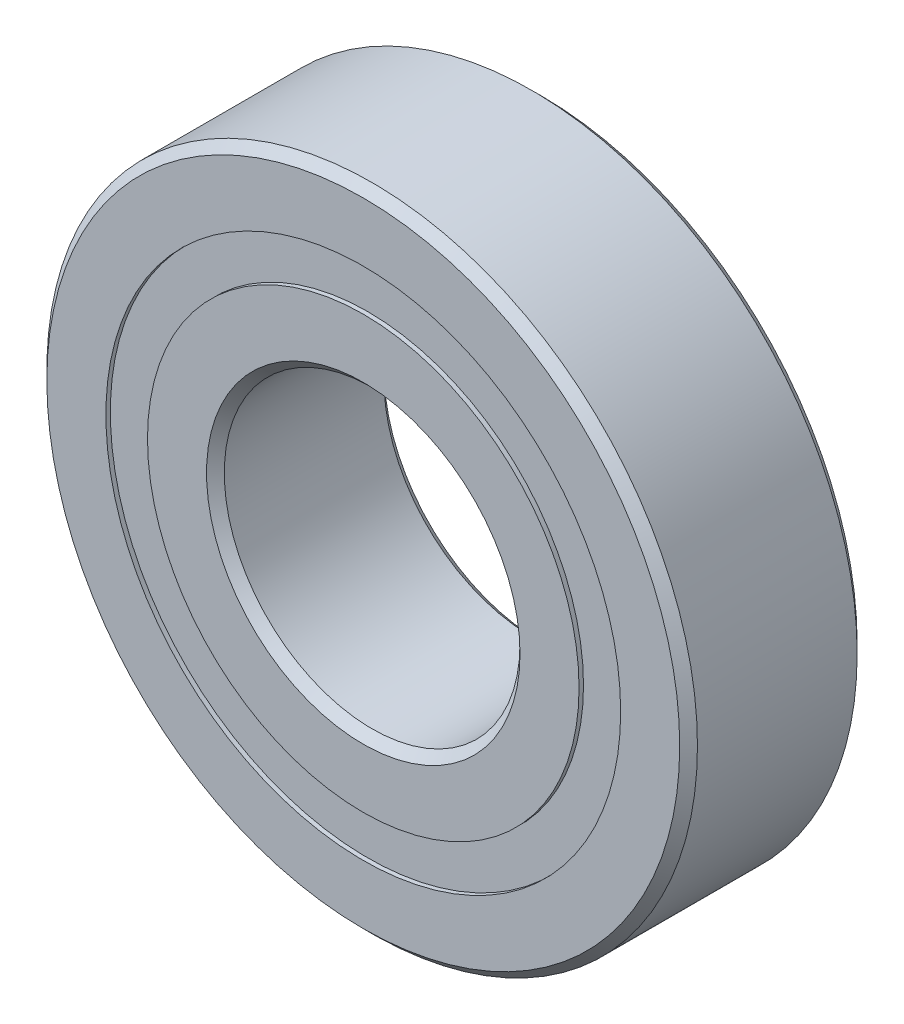
ISO-10303-21;
HEADER;
FILE_DESCRIPTION(('STEP AP214'),'2;1');
FILE_NAME('part.step','',(''),(''),'','','');
FILE_SCHEMA(('AUTOMOTIVE_DESIGN { 1 0 10303 214 1 1 1 1 }'));
ENDSEC;
DATA;
#1=APPLICATION_CONTEXT('core data for automotive mechanical design processes');
#2=APPLICATION_PROTOCOL_DEFINITION('international standard','automotive_design',2000,#1);
#3=PRODUCT_CONTEXT('',#1,'mechanical');
#4=PRODUCT('Part','Part','',(#3));
#5=PRODUCT_RELATED_PRODUCT_CATEGORY('part','',(#4));
#6=PRODUCT_DEFINITION_FORMATION('','',#4);
#7=PRODUCT_DEFINITION_CONTEXT('part definition',#1,'design');
#8=PRODUCT_DEFINITION('design','',#6,#7);
#9=PRODUCT_DEFINITION_SHAPE('','',#8);
#10=(LENGTH_UNIT() NAMED_UNIT(*) SI_UNIT(.MILLI.,.METRE.));
#11=(NAMED_UNIT(*) PLANE_ANGLE_UNIT() SI_UNIT($,.RADIAN.));
#12=(NAMED_UNIT(*) SI_UNIT($,.STERADIAN.) SOLID_ANGLE_UNIT());
#13=UNCERTAINTY_MEASURE_WITH_UNIT(LENGTH_MEASURE(1.E-05),#10,'distance_accuracy_value','');
#14=(GEOMETRIC_REPRESENTATION_CONTEXT(3) GLOBAL_UNCERTAINTY_ASSIGNED_CONTEXT((#13)) GLOBAL_UNIT_ASSIGNED_CONTEXT((#10,
#11,#12)) REPRESENTATION_CONTEXT('',''));
#15=CARTESIAN_POINT('',(0.,0.,0.));
#16=DIRECTION('',(0.,0.,1.));
#17=DIRECTION('',(1.,0.,0.));
#18=AXIS2_PLACEMENT_3D('',#15,#16,#17);
#19=CARTESIAN_POINT('',(0.,8.7032967032967,-2.85000000000001));
#20=DIRECTION('',(0.,0.,1.));
#21=DIRECTION('',(1.,0.,0.));
#22=AXIS2_PLACEMENT_3D('',#19,#20,#21);
#23=PLANE('',#22);
#24=CARTESIAN_POINT('',(0.,0.,-2.85));
#25=DIRECTION('',(0.,0.,1.));
#26=DIRECTION('',(1.,0.,0.));
#27=AXIS2_PLACEMENT_3D('',#24,#25,#26);
#28=CIRCLE('',#27,8.7032967032967);
#29=CARTESIAN_POINT('',(8.7032967032967,0.,-2.85));
#30=VERTEX_POINT('',#29);
#31=EDGE_CURVE('E57',#30,#30,#28,.T.);
#32=ORIENTED_EDGE('',*,*,#31,.F.);
#33=EDGE_LOOP('',(#32));
#34=FACE_BOUND('',#33,.T.);
#35=CARTESIAN_POINT('',(0.,0.,-2.85000000000001));
#36=DIRECTION('',(0.,0.,1.));
#37=DIRECTION('',(1.,0.,0.));
#38=AXIS2_PLACEMENT_3D('',#35,#36,#37);
#39=CIRCLE('',#38,7.2967032967033);
#40=CARTESIAN_POINT('',(7.2967032967033,0.,-2.85000000000001));
#41=VERTEX_POINT('',#40);
#42=EDGE_CURVE('E11',#41,#41,#39,.T.);
#43=ORIENTED_EDGE('',*,*,#42,.T.);
#44=EDGE_LOOP('',(#43));
#45=FACE_BOUND('',#44,.T.);
#46=ADVANCED_FACE('F43',(#34,#45),#23,.F.);
#47=CARTESIAN_POINT('',(0.,0.,3.));
#48=DIRECTION('',(0.,0.,1.));
#49=DIRECTION('',(1.,0.,0.));
#50=AXIS2_PLACEMENT_3D('',#47,#48,#49);
#51=CYLINDRICAL_SURFACE('',#50,7.2967032967033);
#52=ORIENTED_EDGE('',*,*,#42,.F.);
#53=EDGE_LOOP('',(#52));
#54=FACE_BOUND('',#53,.T.);
#55=CARTESIAN_POINT('',(0.,0.,-1.50744951180655));
#56=DIRECTION('',(0.,0.,1.));
#57=DIRECTION('',(1.,0.,0.));
#58=AXIS2_PLACEMENT_3D('',#55,#56,#57);
#59=CIRCLE('',#58,7.2967032967033);
#60=CARTESIAN_POINT('',(7.2967032967033,0.,-1.50744951180655));
#61=VERTEX_POINT('',#60);
#62=EDGE_CURVE('E49',#61,#61,#59,.T.);
#63=ORIENTED_EDGE('',*,*,#62,.T.);
#64=EDGE_LOOP('',(#63));
#65=FACE_BOUND('',#64,.T.);
#66=ADVANCED_FACE('F66',(#54,#65),#51,.F.);
#67=CARTESIAN_POINT('',(0.,8.7032967032967,-1.50744951180655));
#68=DIRECTION('',(0.,0.,-1.));
#69=DIRECTION('',(-1.,0.,0.));
#70=AXIS2_PLACEMENT_3D('',#67,#68,#69);
#71=PLANE('',#70);
#72=ORIENTED_EDGE('',*,*,#62,.F.);
#73=EDGE_LOOP('',(#72));
#74=FACE_BOUND('',#73,.T.);
#75=CARTESIAN_POINT('',(0.,0.,-1.50744951180655));
#76=DIRECTION('',(0.,0.,1.));
#77=DIRECTION('',(1.,0.,0.));
#78=AXIS2_PLACEMENT_3D('',#75,#76,#77);
#79=CIRCLE('',#78,8.7032967032967);
#80=CARTESIAN_POINT('',(8.7032967032967,0.,-1.50744951180655));
#81=VERTEX_POINT('',#80);
#82=EDGE_CURVE('E53',#81,#81,#79,.T.);
#83=ORIENTED_EDGE('',*,*,#82,.T.);
#84=EDGE_LOOP('',(#83));
#85=FACE_BOUND('',#84,.T.);
#86=ADVANCED_FACE('F70',(#74,#85),#71,.F.);
#87=CARTESIAN_POINT('',(0.,0.,3.));
#88=DIRECTION('',(0.,0.,1.));
#89=DIRECTION('',(1.,0.,0.));
#90=AXIS2_PLACEMENT_3D('',#87,#88,#89);
#91=CYLINDRICAL_SURFACE('',#90,8.7032967032967);
#92=ORIENTED_EDGE('',*,*,#82,.F.);
#93=EDGE_LOOP('',(#92));
#94=FACE_BOUND('',#93,.T.);
#95=ORIENTED_EDGE('',*,*,#31,.T.);
#96=EDGE_LOOP('',(#95));
#97=FACE_BOUND('',#96,.T.);
#98=ADVANCED_FACE('F63',(#94,#97),#91,.T.);
#99=CLOSED_SHELL('',(#46,#66,#86,#98));
#100=MANIFOLD_SOLID_BREP('B2',#99);
#101=CARTESIAN_POINT('',(0.,8.7032967032967,2.85));
#102=DIRECTION('',(0.,0.,-1.));
#103=DIRECTION('',(-1.,0.,0.));
#104=AXIS2_PLACEMENT_3D('',#101,#102,#103);
#105=PLANE('',#104);
#106=CARTESIAN_POINT('',(0.,0.,2.85));
#107=DIRECTION('',(0.,0.,1.));
#108=DIRECTION('',(1.,0.,0.));
#109=AXIS2_PLACEMENT_3D('',#106,#107,#108);
#110=CIRCLE('',#109,7.2967032967033);
#111=CARTESIAN_POINT('',(7.2967032967033,0.,2.85));
#112=VERTEX_POINT('',#111);
#113=EDGE_CURVE('E42',#112,#112,#110,.T.);
#114=ORIENTED_EDGE('',*,*,#113,.F.);
#115=EDGE_LOOP('',(#114));
#116=FACE_BOUND('',#115,.T.);
#117=CARTESIAN_POINT('',(0.,0.,2.85));
#118=DIRECTION('',(0.,0.,1.));
#119=DIRECTION('',(1.,0.,0.));
#120=AXIS2_PLACEMENT_3D('',#117,#118,#119);
#121=CIRCLE('',#120,8.7032967032967);
#122=CARTESIAN_POINT('',(8.7032967032967,0.,2.85));
#123=VERTEX_POINT('',#122);
#124=EDGE_CURVE('E124',#123,#123,#121,.T.);
#125=ORIENTED_EDGE('',*,*,#124,.T.);
#126=EDGE_LOOP('',(#125));
#127=FACE_BOUND('',#126,.T.);
#128=ADVANCED_FACE('F110',(#116,#127),#105,.F.);
#129=CARTESIAN_POINT('',(0.,0.,3.));
#130=DIRECTION('',(0.,0.,1.));
#131=DIRECTION('',(1.,0.,0.));
#132=AXIS2_PLACEMENT_3D('',#129,#130,#131);
#133=CYLINDRICAL_SURFACE('',#132,7.2967032967033);
#134=CARTESIAN_POINT('',(0.,0.,1.50744951180654));
#135=DIRECTION('',(0.,0.,1.));
#136=DIRECTION('',(1.,0.,0.));
#137=AXIS2_PLACEMENT_3D('',#134,#135,#136);
#138=CIRCLE('',#137,7.2967032967033);
#139=CARTESIAN_POINT('',(7.2967032967033,0.,1.50744951180654));
#140=VERTEX_POINT('',#139);
#141=EDGE_CURVE('E116',#140,#140,#138,.T.);
#142=ORIENTED_EDGE('',*,*,#141,.F.);
#143=EDGE_LOOP('',(#142));
#144=FACE_BOUND('',#143,.T.);
#145=ORIENTED_EDGE('',*,*,#113,.T.);
#146=EDGE_LOOP('',(#145));
#147=FACE_BOUND('',#146,.T.);
#148=ADVANCED_FACE('F139',(#144,#147),#133,.F.);
#149=CARTESIAN_POINT('',(0.,8.7032967032967,1.50744951180654));
#150=DIRECTION('',(0.,0.,1.));
#151=DIRECTION('',(1.,0.,0.));
#152=AXIS2_PLACEMENT_3D('',#149,#150,#151);
#153=PLANE('',#152);
#154=CARTESIAN_POINT('',(0.,0.,1.50744951180654));
#155=DIRECTION('',(0.,0.,1.));
#156=DIRECTION('',(1.,0.,0.));
#157=AXIS2_PLACEMENT_3D('',#154,#155,#156);
#158=CIRCLE('',#157,8.7032967032967);
#159=CARTESIAN_POINT('',(8.7032967032967,0.,1.50744951180654));
#160=VERTEX_POINT('',#159);
#161=EDGE_CURVE('E120',#160,#160,#158,.T.);
#162=ORIENTED_EDGE('',*,*,#161,.F.);
#163=EDGE_LOOP('',(#162));
#164=FACE_BOUND('',#163,.T.);
#165=ORIENTED_EDGE('',*,*,#141,.T.);
#166=EDGE_LOOP('',(#165));
#167=FACE_BOUND('',#166,.T.);
#168=ADVANCED_FACE('F134',(#164,#167),#153,.F.);
#169=CARTESIAN_POINT('',(0.,0.,3.));
#170=DIRECTION('',(0.,0.,1.));
#171=DIRECTION('',(1.,0.,0.));
#172=AXIS2_PLACEMENT_3D('',#169,#170,#171);
#173=CYLINDRICAL_SURFACE('',#172,8.7032967032967);
#174=ORIENTED_EDGE('',*,*,#124,.F.);
#175=EDGE_LOOP('',(#174));
#176=FACE_BOUND('',#175,.T.);
#177=ORIENTED_EDGE('',*,*,#161,.T.);
#178=EDGE_LOOP('',(#177));
#179=FACE_BOUND('',#178,.T.);
#180=ADVANCED_FACE('F131',(#176,#179),#173,.T.);
#181=CLOSED_SHELL('',(#128,#148,#168,#180));
#182=MANIFOLD_SOLID_BREP('B6',#181);
#183=CARTESIAN_POINT('',(-3.99999999999991,6.92820323027556,0.));
#184=DIRECTION('',(0.,0.,1.));
#185=DIRECTION('',(-0.499999999999989,0.866025403784445,0.));
#186=AXIS2_PLACEMENT_3D('',#183,#184,#185);
#187=SPHERICAL_SURFACE('',#186,1.50744951180654);
#188=CARTESIAN_POINT('',(-3.99999999999991,6.92820323027556,1.50744951180654));
#189=VERTEX_POINT('',#188);
#190=VERTEX_LOOP('',#189);
#191=FACE_BOUND('',#190,.T.);
#192=ADVANCED_FACE('F177',(#191),#187,.T.);
#193=CLOSED_SHELL('',(#192));
#194=MANIFOLD_SOLID_BREP('B37',#193);
#195=CARTESIAN_POINT('',(-6.92820323027546,4.00000000000008,0.));
#196=DIRECTION('',(0.,0.,1.));
#197=DIRECTION('',(-0.866025403784433,0.50000000000001,0.));
#198=AXIS2_PLACEMENT_3D('',#195,#196,#197);
#199=SPHERICAL_SURFACE('',#198,1.50744951180654);
#200=CARTESIAN_POINT('',(-6.92820323027546,4.00000000000008,1.50744951180654));
#201=VERTEX_POINT('',#200);
#202=VERTEX_LOOP('',#201);
#203=FACE_BOUND('',#202,.T.);
#204=ADVANCED_FACE('F197',(#203),#199,.T.);
#205=CLOSED_SHELL('',(#204));
#206=MANIFOLD_SOLID_BREP('B106',#205);
#207=CARTESIAN_POINT('',(-8.,0.,0.));
#208=DIRECTION('',(0.,0.,1.));
#209=DIRECTION('',(-1.,0.,0.));
#210=AXIS2_PLACEMENT_3D('',#207,#208,#209);
#211=SPHERICAL_SURFACE('',#210,1.50744951180654);
#212=CARTESIAN_POINT('',(-8.,0.,1.50744951180654));
#213=VERTEX_POINT('',#212);
#214=VERTEX_LOOP('',#213);
#215=FACE_BOUND('',#214,.T.);
#216=ADVANCED_FACE('F217',(#215),#211,.T.);
#217=CLOSED_SHELL('',(#216));
#218=MANIFOLD_SOLID_BREP('B173',#217);
#219=CARTESIAN_POINT('',(-6.92820323027555,-3.99999999999994,0.));
#220=DIRECTION('',(0.,0.,1.));
#221=DIRECTION('',(-0.866025403784443,-0.499999999999992,0.));
#222=AXIS2_PLACEMENT_3D('',#219,#220,#221);
#223=SPHERICAL_SURFACE('',#222,1.50744951180654);
#224=CARTESIAN_POINT('',(-6.92820323027555,-3.99999999999994,1.50744951180654));
#225=VERTEX_POINT('',#224);
#226=VERTEX_LOOP('',#225);
#227=FACE_BOUND('',#226,.T.);
#228=ADVANCED_FACE('F237',(#227),#223,.T.);
#229=CLOSED_SHELL('',(#228));
#230=MANIFOLD_SOLID_BREP('B193',#229);
#231=CARTESIAN_POINT('',(-4.00000000000006,-6.92820323027548,0.));
#232=DIRECTION('',(0.,0.,1.));
#233=DIRECTION('',(-0.500000000000007,-0.866025403784435,0.));
#234=AXIS2_PLACEMENT_3D('',#231,#232,#233);
#235=SPHERICAL_SURFACE('',#234,1.50744951180654);
#236=CARTESIAN_POINT('',(-4.00000000000006,-6.92820323027548,1.50744951180654));
#237=VERTEX_POINT('',#236);
#238=VERTEX_LOOP('',#237);
#239=FACE_BOUND('',#238,.T.);
#240=ADVANCED_FACE('F257',(#239),#235,.T.);
#241=CLOSED_SHELL('',(#240));
#242=MANIFOLD_SOLID_BREP('B213',#241);
#243=CARTESIAN_POINT('',(0.,-8.,0.));
#244=DIRECTION('',(0.,0.,1.));
#245=DIRECTION('',(0.,-1.,0.));
#246=AXIS2_PLACEMENT_3D('',#243,#244,#245);
#247=SPHERICAL_SURFACE('',#246,1.50744951180654);
#248=CARTESIAN_POINT('',(0.,-8.,1.50744951180654));
#249=VERTEX_POINT('',#248);
#250=VERTEX_LOOP('',#249);
#251=FACE_BOUND('',#250,.T.);
#252=ADVANCED_FACE('F277',(#251),#247,.T.);
#253=CLOSED_SHELL('',(#252));
#254=MANIFOLD_SOLID_BREP('B233',#253);
#255=CARTESIAN_POINT('',(3.99999999999996,-6.92820323027553,0.));
#256=DIRECTION('',(0.,0.,1.));
#257=DIRECTION('',(0.499999999999995,-0.866025403784442,0.));
#258=AXIS2_PLACEMENT_3D('',#255,#256,#257);
#259=SPHERICAL_SURFACE('',#258,1.50744951180654);
#260=CARTESIAN_POINT('',(3.99999999999996,-6.92820323027553,1.50744951180654));
#261=VERTEX_POINT('',#260);
#262=VERTEX_LOOP('',#261);
#263=FACE_BOUND('',#262,.T.);
#264=ADVANCED_FACE('F297',(#263),#259,.T.);
#265=CLOSED_SHELL('',(#264));
#266=MANIFOLD_SOLID_BREP('B253',#265);
#267=CARTESIAN_POINT('',(6.92820323027549,-4.00000000000003,0.));
#268=DIRECTION('',(0.,0.,1.));
#269=DIRECTION('',(0.866025403784436,-0.500000000000004,0.));
#270=AXIS2_PLACEMENT_3D('',#267,#268,#269);
#271=SPHERICAL_SURFACE('',#270,1.50744951180654);
#272=CARTESIAN_POINT('',(6.92820323027549,-4.00000000000003,1.50744951180654));
#273=VERTEX_POINT('',#272);
#274=VERTEX_LOOP('',#273);
#275=FACE_BOUND('',#274,.T.);
#276=ADVANCED_FACE('F317',(#275),#271,.T.);
#277=CLOSED_SHELL('',(#276));
#278=MANIFOLD_SOLID_BREP('B273',#277);
#279=CARTESIAN_POINT('',(8.,0.,0.));
#280=DIRECTION('',(0.,0.,1.));
#281=DIRECTION('',(1.,0.,0.));
#282=AXIS2_PLACEMENT_3D('',#279,#280,#281);
#283=SPHERICAL_SURFACE('',#282,1.50744951180654);
#284=CARTESIAN_POINT('',(8.,0.,1.50744951180654));
#285=VERTEX_POINT('',#284);
#286=VERTEX_LOOP('',#285);
#287=FACE_BOUND('',#286,.T.);
#288=ADVANCED_FACE('F337',(#287),#283,.T.);
#289=CLOSED_SHELL('',(#288));
#290=MANIFOLD_SOLID_BREP('B293',#289);
#291=CARTESIAN_POINT('',(6.92820323027552,3.99999999999998,0.));
#292=DIRECTION('',(0.,0.,1.));
#293=DIRECTION('',(0.86602540378444,0.499999999999998,0.));
#294=AXIS2_PLACEMENT_3D('',#291,#292,#293);
#295=SPHERICAL_SURFACE('',#294,1.50744951180654);
#296=CARTESIAN_POINT('',(6.92820323027552,3.99999999999998,1.50744951180654));
#297=VERTEX_POINT('',#296);
#298=VERTEX_LOOP('',#297);
#299=FACE_BOUND('',#298,.T.);
#300=ADVANCED_FACE('F357',(#299),#295,.T.);
#301=CLOSED_SHELL('',(#300));
#302=MANIFOLD_SOLID_BREP('B313',#301);
#303=CARTESIAN_POINT('',(4.00000000000001,6.9282032302755,0.));
#304=DIRECTION('',(0.,0.,1.));
#305=DIRECTION('',(0.500000000000001,0.866025403784438,0.));
#306=AXIS2_PLACEMENT_3D('',#303,#304,#305);
#307=SPHERICAL_SURFACE('',#306,1.50744951180654);
#308=CARTESIAN_POINT('',(4.00000000000001,6.9282032302755,1.50744951180654));
#309=VERTEX_POINT('',#308);
#310=VERTEX_LOOP('',#309);
#311=FACE_BOUND('',#310,.T.);
#312=ADVANCED_FACE('F377',(#311),#307,.T.);
#313=CLOSED_SHELL('',(#312));
#314=MANIFOLD_SOLID_BREP('B333',#313);
#315=CARTESIAN_POINT('',(0.,8.,0.));
#316=DIRECTION('',(0.,0.,1.));
#317=DIRECTION('',(0.,1.,0.));
#318=AXIS2_PLACEMENT_3D('',#315,#316,#317);
#319=SPHERICAL_SURFACE('',#318,1.50744951180654);
#320=CARTESIAN_POINT('',(0.,8.,1.50744951180654));
#321=VERTEX_POINT('',#320);
#322=VERTEX_LOOP('',#321);
#323=FACE_BOUND('',#322,.T.);
#324=ADVANCED_FACE('F399',(#323),#319,.T.);
#325=CLOSED_SHELL('',(#324));
#326=MANIFOLD_SOLID_BREP('B353',#325);
#327=CARTESIAN_POINT('',(0.,7.2967032967033,3.));
#328=DIRECTION('',(0.,0.,-1.));
#329=DIRECTION('',(-1.,0.,0.));
#330=AXIS2_PLACEMENT_3D('',#327,#328,#329);
#331=PLANE('',#330);
#332=CARTESIAN_POINT('',(0.,0.,3.));
#333=DIRECTION('',(0.,0.,1.));
#334=DIRECTION('',(1.,0.,0.));
#335=AXIS2_PLACEMENT_3D('',#332,#333,#334);
#336=CIRCLE('',#335,5.3);
#337=CARTESIAN_POINT('',(5.3,0.,3.));
#338=VERTEX_POINT('',#337);
#339=EDGE_CURVE('E446',#338,#338,#336,.T.);
#340=ORIENTED_EDGE('',*,*,#339,.F.);
#341=EDGE_LOOP('',(#340));
#342=FACE_BOUND('',#341,.T.);
#343=CARTESIAN_POINT('',(0.,0.,3.));
#344=DIRECTION('',(0.,0.,1.));
#345=DIRECTION('',(1.,0.,0.));
#346=AXIS2_PLACEMENT_3D('',#343,#344,#345);
#347=CIRCLE('',#346,7.2967032967033);
#348=CARTESIAN_POINT('',(7.2967032967033,0.,3.));
#349=VERTEX_POINT('',#348);
#350=EDGE_CURVE('E398',#349,#349,#347,.T.);
#351=ORIENTED_EDGE('',*,*,#350,.T.);
#352=EDGE_LOOP('',(#351));
#353=FACE_BOUND('',#352,.T.);
#354=ADVANCED_FACE('F418',(#342,#353),#331,.F.);
#355=CARTESIAN_POINT('',(0.,0.,3.));
#356=DIRECTION('',(0.,0.,1.));
#357=DIRECTION('',(1.,0.,0.));
#358=AXIS2_PLACEMENT_3D('',#355,#356,#357);
#359=CYLINDRICAL_SURFACE('',#358,7.2967032967033);
#360=ORIENTED_EDGE('',*,*,#350,.F.);
#361=EDGE_LOOP('',(#360));
#362=FACE_BOUND('',#361,.T.);
#363=CARTESIAN_POINT('',(0.,0.,1.33333333333333));
#364=DIRECTION('',(0.,0.,1.));
#365=DIRECTION('',(1.,0.,0.));
#366=AXIS2_PLACEMENT_3D('',#363,#364,#365);
#367=CIRCLE('',#366,7.2967032967033);
#368=CARTESIAN_POINT('',(7.2967032967033,0.,1.33333333333333));
#369=VERTEX_POINT('',#368);
#370=EDGE_CURVE('E424',#369,#369,#367,.T.);
#371=ORIENTED_EDGE('',*,*,#370,.T.);
#372=EDGE_LOOP('',(#371));
#373=FACE_BOUND('',#372,.T.);
#374=ADVANCED_FACE('F453',(#362,#373),#359,.T.);
#375=CARTESIAN_POINT('',(0.,0.,0.));
#376=DIRECTION('',(0.,0.,1.));
#377=DIRECTION('',(1.,0.,0.));
#378=AXIS2_PLACEMENT_3D('',#375,#376,#377);
#379=TOROIDAL_SURFACE('',#378,8.,1.50744951180654);
#380=ORIENTED_EDGE('',*,*,#370,.F.);
#381=EDGE_LOOP('',(#380));
#382=FACE_BOUND('',#381,.T.);
#383=CARTESIAN_POINT('',(0.,0.,-1.33333333333333));
#384=DIRECTION('',(0.,0.,1.));
#385=DIRECTION('',(1.,0.,0.));
#386=AXIS2_PLACEMENT_3D('',#383,#384,#385);
#387=CIRCLE('',#386,7.2967032967033);
#388=CARTESIAN_POINT('',(7.2967032967033,0.,-1.33333333333333));
#389=VERTEX_POINT('',#388);
#390=EDGE_CURVE('E428',#389,#389,#387,.T.);
#391=ORIENTED_EDGE('',*,*,#390,.T.);
#392=EDGE_LOOP('',(#391));
#393=FACE_BOUND('',#392,.T.);
#394=ADVANCED_FACE('F457',(#382,#393),#379,.F.);
#395=CARTESIAN_POINT('',(0.,0.,3.));
#396=DIRECTION('',(0.,0.,1.));
#397=DIRECTION('',(1.,0.,0.));
#398=AXIS2_PLACEMENT_3D('',#395,#396,#397);
#399=CYLINDRICAL_SURFACE('',#398,7.2967032967033);
#400=ORIENTED_EDGE('',*,*,#390,.F.);
#401=EDGE_LOOP('',(#400));
#402=FACE_BOUND('',#401,.T.);
#403=CARTESIAN_POINT('',(0.,0.,-3.));
#404=DIRECTION('',(0.,0.,1.));
#405=DIRECTION('',(1.,0.,0.));
#406=AXIS2_PLACEMENT_3D('',#403,#404,#405);
#407=CIRCLE('',#406,7.2967032967033);
#408=CARTESIAN_POINT('',(7.2967032967033,0.,-3.));
#409=VERTEX_POINT('',#408);
#410=EDGE_CURVE('E432',#409,#409,#407,.T.);
#411=ORIENTED_EDGE('',*,*,#410,.T.);
#412=EDGE_LOOP('',(#411));
#413=FACE_BOUND('',#412,.T.);
#414=ADVANCED_FACE('F462',(#402,#413),#399,.T.);
#415=CARTESIAN_POINT('',(0.,5.3,-3.));
#416=DIRECTION('',(0.,0.,1.));
#417=DIRECTION('',(1.,0.,0.));
#418=AXIS2_PLACEMENT_3D('',#415,#416,#417);
#419=PLANE('',#418);
#420=ORIENTED_EDGE('',*,*,#410,.F.);
#421=EDGE_LOOP('',(#420));
#422=FACE_BOUND('',#421,.T.);
#423=CARTESIAN_POINT('',(0.,0.,-3.));
#424=DIRECTION('',(0.,0.,1.));
#425=DIRECTION('',(1.,0.,0.));
#426=AXIS2_PLACEMENT_3D('',#423,#424,#425);
#427=CIRCLE('',#426,5.3);
#428=CARTESIAN_POINT('',(5.3,0.,-3.));
#429=VERTEX_POINT('',#428);
#430=EDGE_CURVE('E437',#429,#429,#427,.T.);
#431=ORIENTED_EDGE('',*,*,#430,.T.);
#432=EDGE_LOOP('',(#431));
#433=FACE_BOUND('',#432,.T.);
#434=ADVANCED_FACE('F468',(#422,#433),#419,.F.);
#435=CARTESIAN_POINT('',(0.,0.,-2.7));
#436=DIRECTION('',(0.,0.,-1.));
#437=DIRECTION('',(-1.,0.,0.));
#438=AXIS2_PLACEMENT_3D('',#435,#436,#437);
#439=CONICAL_SURFACE('',#438,5.,0.785398163397443);
#440=ORIENTED_EDGE('',*,*,#430,.F.);
#441=EDGE_LOOP('',(#440));
#442=FACE_BOUND('',#441,.T.);
#443=CARTESIAN_POINT('',(0.,0.,-2.7));
#444=DIRECTION('',(0.,0.,1.));
#445=DIRECTION('',(1.,0.,0.));
#446=AXIS2_PLACEMENT_3D('',#443,#444,#445);
#447=CIRCLE('',#446,5.);
#448=CARTESIAN_POINT('',(5.,0.,-2.7));
#449=VERTEX_POINT('',#448);
#450=EDGE_CURVE('E440',#449,#449,#447,.T.);
#451=ORIENTED_EDGE('',*,*,#450,.T.);
#452=EDGE_LOOP('',(#451));
#453=FACE_BOUND('',#452,.T.);
#454=ADVANCED_FACE('F472',(#442,#453),#439,.F.);
#455=CARTESIAN_POINT('',(0.,0.,3.));
#456=DIRECTION('',(0.,0.,1.));
#457=DIRECTION('',(1.,0.,0.));
#458=AXIS2_PLACEMENT_3D('',#455,#456,#457);
#459=CYLINDRICAL_SURFACE('',#458,5.);
#460=ORIENTED_EDGE('',*,*,#450,.F.);
#461=EDGE_LOOP('',(#460));
#462=FACE_BOUND('',#461,.T.);
#463=CARTESIAN_POINT('',(0.,0.,2.70000000000001));
#464=DIRECTION('',(0.,0.,1.));
#465=DIRECTION('',(1.,0.,0.));
#466=AXIS2_PLACEMENT_3D('',#463,#464,#465);
#467=CIRCLE('',#466,5.);
#468=CARTESIAN_POINT('',(5.,0.,2.70000000000001));
#469=VERTEX_POINT('',#468);
#470=EDGE_CURVE('E443',#469,#469,#467,.T.);
#471=ORIENTED_EDGE('',*,*,#470,.T.);
#472=EDGE_LOOP('',(#471));
#473=FACE_BOUND('',#472,.T.);
#474=ADVANCED_FACE('F476',(#462,#473),#459,.F.);
#475=CARTESIAN_POINT('',(0.,0.,3.));
#476=DIRECTION('',(0.,0.,1.));
#477=DIRECTION('',(1.,0.,0.));
#478=AXIS2_PLACEMENT_3D('',#475,#476,#477);
#479=CONICAL_SURFACE('',#478,5.3,0.785398163397455);
#480=ORIENTED_EDGE('',*,*,#470,.F.);
#481=EDGE_LOOP('',(#480));
#482=FACE_BOUND('',#481,.T.);
#483=ORIENTED_EDGE('',*,*,#339,.T.);
#484=EDGE_LOOP('',(#483));
#485=FACE_BOUND('',#484,.T.);
#486=ADVANCED_FACE('F450',(#482,#485),#479,.F.);
#487=CLOSED_SHELL('',(#354,#374,#394,#414,#434,#454,#474,#486));
#488=MANIFOLD_SOLID_BREP('B373',#487);
#489=CARTESIAN_POINT('',(0.,0.,2.7));
#490=DIRECTION('',(0.,0.,-1.));
#491=DIRECTION('',(-1.,0.,0.));
#492=AXIS2_PLACEMENT_3D('',#489,#490,#491);
#493=CONICAL_SURFACE('',#492,11.,0.785398163397443);
#494=CARTESIAN_POINT('',(0.,0.,3.));
#495=DIRECTION('',(0.,0.,1.));
#496=DIRECTION('',(1.,0.,0.));
#497=AXIS2_PLACEMENT_3D('',#494,#495,#496);
#498=CIRCLE('',#497,10.7);
#499=CARTESIAN_POINT('',(10.7,0.,3.));
#500=VERTEX_POINT('',#499);
#501=EDGE_CURVE('E567',#500,#500,#498,.T.);
#502=ORIENTED_EDGE('',*,*,#501,.F.);
#503=EDGE_LOOP('',(#502));
#504=FACE_BOUND('',#503,.T.);
#505=CARTESIAN_POINT('',(0.,0.,2.7));
#506=DIRECTION('',(0.,0.,1.));
#507=DIRECTION('',(1.,0.,0.));
#508=AXIS2_PLACEMENT_3D('',#505,#506,#507);
#509=CIRCLE('',#508,11.);
#510=CARTESIAN_POINT('',(11.,0.,2.7));
#511=VERTEX_POINT('',#510);
#512=EDGE_CURVE('E417',#511,#511,#509,.T.);
#513=ORIENTED_EDGE('',*,*,#512,.T.);
#514=EDGE_LOOP('',(#513));
#515=FACE_BOUND('',#514,.T.);
#516=ADVANCED_FACE('F539',(#504,#515),#493,.T.);
#517=CARTESIAN_POINT('',(0.,0.,3.));
#518=DIRECTION('',(0.,0.,1.));
#519=DIRECTION('',(1.,0.,0.));
#520=AXIS2_PLACEMENT_3D('',#517,#518,#519);
#521=CYLINDRICAL_SURFACE('',#520,11.);
#522=ORIENTED_EDGE('',*,*,#512,.F.);
#523=EDGE_LOOP('',(#522));
#524=FACE_BOUND('',#523,.T.);
#525=CARTESIAN_POINT('',(0.,0.,-2.7));
#526=DIRECTION('',(0.,0.,1.));
#527=DIRECTION('',(1.,0.,0.));
#528=AXIS2_PLACEMENT_3D('',#525,#526,#527);
#529=CIRCLE('',#528,11.);
#530=CARTESIAN_POINT('',(11.,0.,-2.7));
#531=VERTEX_POINT('',#530);
#532=EDGE_CURVE('E545',#531,#531,#529,.T.);
#533=ORIENTED_EDGE('',*,*,#532,.T.);
#534=EDGE_LOOP('',(#533));
#535=FACE_BOUND('',#534,.T.);
#536=ADVANCED_FACE('F574',(#524,#535),#521,.T.);
#537=CARTESIAN_POINT('',(0.,0.,-3.));
#538=DIRECTION('',(0.,0.,1.));
#539=DIRECTION('',(1.,0.,0.));
#540=AXIS2_PLACEMENT_3D('',#537,#538,#539);
#541=CONICAL_SURFACE('',#540,10.7,0.785398163397443);
#542=ORIENTED_EDGE('',*,*,#532,.F.);
#543=EDGE_LOOP('',(#542));
#544=FACE_BOUND('',#543,.T.);
#545=CARTESIAN_POINT('',(0.,0.,-3.));
#546=DIRECTION('',(0.,0.,1.));
#547=DIRECTION('',(1.,0.,0.));
#548=AXIS2_PLACEMENT_3D('',#545,#546,#547);
#549=CIRCLE('',#548,10.7);
#550=CARTESIAN_POINT('',(10.7,0.,-3.));
#551=VERTEX_POINT('',#550);
#552=EDGE_CURVE('E549',#551,#551,#549,.T.);
#553=ORIENTED_EDGE('',*,*,#552,.T.);
#554=EDGE_LOOP('',(#553));
#555=FACE_BOUND('',#554,.T.);
#556=ADVANCED_FACE('F578',(#544,#555),#541,.T.);
#557=CARTESIAN_POINT('',(0.,10.7,-3.));
#558=DIRECTION('',(0.,0.,1.));
#559=DIRECTION('',(1.,0.,0.));
#560=AXIS2_PLACEMENT_3D('',#557,#558,#559);
#561=PLANE('',#560);
#562=ORIENTED_EDGE('',*,*,#552,.F.);
#563=EDGE_LOOP('',(#562));
#564=FACE_BOUND('',#563,.T.);
#565=CARTESIAN_POINT('',(0.,0.,-3.));
#566=DIRECTION('',(0.,0.,1.));
#567=DIRECTION('',(1.,0.,0.));
#568=AXIS2_PLACEMENT_3D('',#565,#566,#567);
#569=CIRCLE('',#568,8.7032967032967);
#570=CARTESIAN_POINT('',(8.7032967032967,0.,-3.));
#571=VERTEX_POINT('',#570);
#572=EDGE_CURVE('E553',#571,#571,#569,.T.);
#573=ORIENTED_EDGE('',*,*,#572,.T.);
#574=EDGE_LOOP('',(#573));
#575=FACE_BOUND('',#574,.T.);
#576=ADVANCED_FACE('F583',(#564,#575),#561,.F.);
#577=CARTESIAN_POINT('',(0.,0.,3.));
#578=DIRECTION('',(0.,0.,1.));
#579=DIRECTION('',(1.,0.,0.));
#580=AXIS2_PLACEMENT_3D('',#577,#578,#579);
#581=CYLINDRICAL_SURFACE('',#580,8.7032967032967);
#582=ORIENTED_EDGE('',*,*,#572,.F.);
#583=EDGE_LOOP('',(#582));
#584=FACE_BOUND('',#583,.T.);
#585=CARTESIAN_POINT('',(0.,0.,-1.33333333333333));
#586=DIRECTION('',(0.,0.,1.));
#587=DIRECTION('',(1.,0.,0.));
#588=AXIS2_PLACEMENT_3D('',#585,#586,#587);
#589=CIRCLE('',#588,8.7032967032967);
#590=CARTESIAN_POINT('',(8.7032967032967,0.,-1.33333333333333));
#591=VERTEX_POINT('',#590);
#592=EDGE_CURVE('E558',#591,#591,#589,.T.);
#593=ORIENTED_EDGE('',*,*,#592,.T.);
#594=EDGE_LOOP('',(#593));
#595=FACE_BOUND('',#594,.T.);
#596=ADVANCED_FACE('F589',(#584,#595),#581,.F.);
#597=CARTESIAN_POINT('',(0.,0.,0.));
#598=DIRECTION('',(0.,0.,1.));
#599=DIRECTION('',(1.,0.,0.));
#600=AXIS2_PLACEMENT_3D('',#597,#598,#599);
#601=TOROIDAL_SURFACE('',#600,8.,1.50744951180654);
#602=ORIENTED_EDGE('',*,*,#592,.F.);
#603=EDGE_LOOP('',(#602));
#604=FACE_BOUND('',#603,.T.);
#605=CARTESIAN_POINT('',(0.,0.,1.33333333333333));
#606=DIRECTION('',(0.,0.,1.));
#607=DIRECTION('',(1.,0.,0.));
#608=AXIS2_PLACEMENT_3D('',#605,#606,#607);
#609=CIRCLE('',#608,8.7032967032967);
#610=CARTESIAN_POINT('',(8.7032967032967,0.,1.33333333333333));
#611=VERTEX_POINT('',#610);
#612=EDGE_CURVE('E561',#611,#611,#609,.T.);
#613=ORIENTED_EDGE('',*,*,#612,.T.);
#614=EDGE_LOOP('',(#613));
#615=FACE_BOUND('',#614,.T.);
#616=ADVANCED_FACE('F593',(#604,#615),#601,.F.);
#617=CARTESIAN_POINT('',(0.,0.,3.));
#618=DIRECTION('',(0.,0.,1.));
#619=DIRECTION('',(1.,0.,0.));
#620=AXIS2_PLACEMENT_3D('',#617,#618,#619);
#621=CYLINDRICAL_SURFACE('',#620,8.7032967032967);
#622=ORIENTED_EDGE('',*,*,#612,.F.);
#623=EDGE_LOOP('',(#622));
#624=FACE_BOUND('',#623,.T.);
#625=CARTESIAN_POINT('',(0.,0.,3.));
#626=DIRECTION('',(0.,0.,1.));
#627=DIRECTION('',(1.,0.,0.));
#628=AXIS2_PLACEMENT_3D('',#625,#626,#627);
#629=CIRCLE('',#628,8.7032967032967);
#630=CARTESIAN_POINT('',(8.7032967032967,0.,3.));
#631=VERTEX_POINT('',#630);
#632=EDGE_CURVE('E564',#631,#631,#629,.T.);
#633=ORIENTED_EDGE('',*,*,#632,.T.);
#634=EDGE_LOOP('',(#633));
#635=FACE_BOUND('',#634,.T.);
#636=ADVANCED_FACE('F597',(#624,#635),#621,.F.);
#637=CARTESIAN_POINT('',(0.,10.7,3.));
#638=DIRECTION('',(0.,0.,-1.));
#639=DIRECTION('',(-1.,0.,0.));
#640=AXIS2_PLACEMENT_3D('',#637,#638,#639);
#641=PLANE('',#640);
#642=ORIENTED_EDGE('',*,*,#632,.F.);
#643=EDGE_LOOP('',(#642));
#644=FACE_BOUND('',#643,.T.);
#645=ORIENTED_EDGE('',*,*,#501,.T.);
#646=EDGE_LOOP('',(#645));
#647=FACE_BOUND('',#646,.T.);
#648=ADVANCED_FACE('F571',(#644,#647),#641,.F.);
#649=CLOSED_SHELL('',(#516,#536,#556,#576,#596,#616,#636,#648));
#650=MANIFOLD_SOLID_BREP('B393',#649);
#651=ADVANCED_BREP_SHAPE_REPRESENTATION('',(#18,#100,#182,#194,#206,#218,#230,#242,#254,#266,
#278,#290,#302,#314,#326,#488,#650),#14);
#652=SHAPE_DEFINITION_REPRESENTATION(#9,#651);
ENDSEC;
END-ISO-10303-21;
